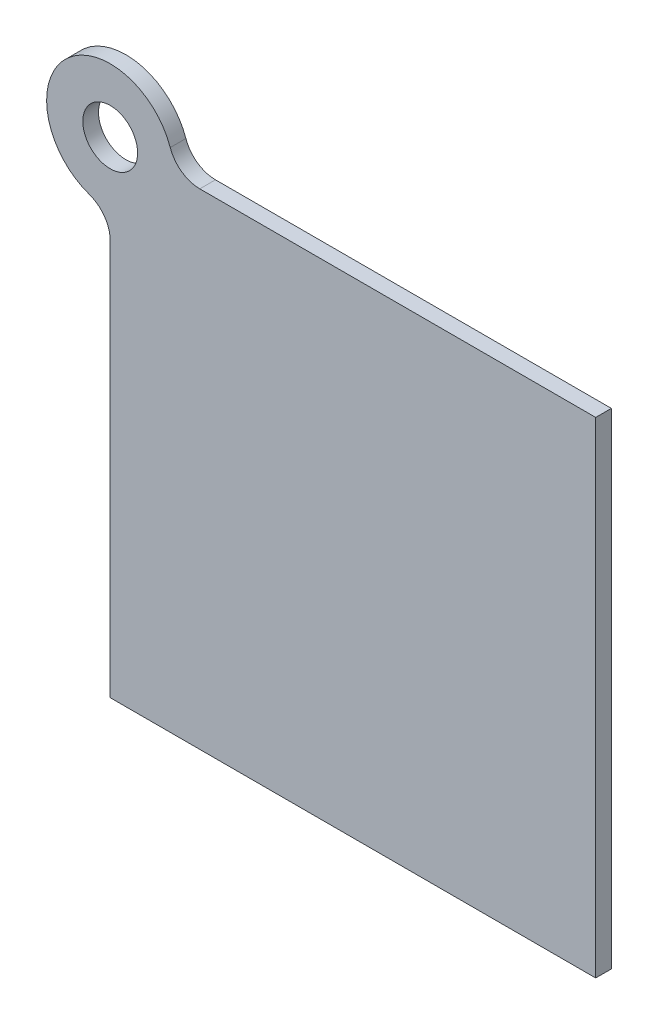
ISO-10303-21;
HEADER;
FILE_DESCRIPTION(('STEP AP214'),'2;1');
FILE_NAME('part.step','',(''),(''),'','','');
FILE_SCHEMA(('AUTOMOTIVE_DESIGN { 1 0 10303 214 1 1 1 1 }'));
ENDSEC;
DATA;
#1=APPLICATION_CONTEXT('core data for automotive mechanical design processes');
#2=APPLICATION_PROTOCOL_DEFINITION('international standard','automotive_design',2000,#1);
#3=PRODUCT_CONTEXT('',#1,'mechanical');
#4=PRODUCT('Part','Part','',(#3));
#5=PRODUCT_RELATED_PRODUCT_CATEGORY('part','',(#4));
#6=PRODUCT_DEFINITION_FORMATION('','',#4);
#7=PRODUCT_DEFINITION_CONTEXT('part definition',#1,'design');
#8=PRODUCT_DEFINITION('design','',#6,#7);
#9=PRODUCT_DEFINITION_SHAPE('','',#8);
#10=(LENGTH_UNIT() NAMED_UNIT(*) SI_UNIT(.MILLI.,.METRE.));
#11=(NAMED_UNIT(*) PLANE_ANGLE_UNIT() SI_UNIT($,.RADIAN.));
#12=(NAMED_UNIT(*) SI_UNIT($,.STERADIAN.) SOLID_ANGLE_UNIT());
#13=UNCERTAINTY_MEASURE_WITH_UNIT(LENGTH_MEASURE(1.E-05),#10,'distance_accuracy_value','');
#14=(GEOMETRIC_REPRESENTATION_CONTEXT(3) GLOBAL_UNCERTAINTY_ASSIGNED_CONTEXT((#13)) GLOBAL_UNIT_ASSIGNED_CONTEXT((#10,
#11,#12)) REPRESENTATION_CONTEXT('',''));
#15=CARTESIAN_POINT('',(0.,0.,0.));
#16=DIRECTION('',(0.,0.,1.));
#17=DIRECTION('',(1.,0.,0.));
#18=AXIS2_PLACEMENT_3D('',#15,#16,#17);
#19=CARTESIAN_POINT('',(0.,0.,2.54));
#20=DIRECTION('',(0.,0.,1.));
#21=DIRECTION('',(1.,0.,0.));
#22=AXIS2_PLACEMENT_3D('',#19,#20,#21);
#23=PLANE('',#22);
#24=DIRECTION('',(1.,0.,0.));
#25=VECTOR('',#24,1.);
#26=CARTESIAN_POINT('',(0.,-78.74,2.54));
#27=LINE('',#26,#25);
#28=CARTESIAN_POINT('',(0.,-78.74,2.54));
#29=VERTEX_POINT('',#28);
#30=CARTESIAN_POINT('',(78.74,-78.74,2.54));
#31=VERTEX_POINT('',#30);
#32=EDGE_CURVE('E102',#29,#31,#27,.T.);
#33=ORIENTED_EDGE('',*,*,#32,.T.);
#34=DIRECTION('',(0.,1.,0.));
#35=VECTOR('',#34,1.);
#36=CARTESIAN_POINT('',(78.74,-78.74,2.54));
#37=LINE('',#36,#35);
#38=CARTESIAN_POINT('',(78.74,0.,2.54));
#39=VERTEX_POINT('',#38);
#40=EDGE_CURVE('E92',#31,#39,#37,.T.);
#41=ORIENTED_EDGE('',*,*,#40,.T.);
#42=DIRECTION('',(-1.,0.,0.));
#43=VECTOR('',#42,1.);
#44=CARTESIAN_POINT('',(78.74,0.,2.54));
#45=LINE('',#44,#43);
#46=CARTESIAN_POINT('',(14.5299544995846,0.,2.54));
#47=VERTEX_POINT('',#46);
#48=EDGE_CURVE('E101',#39,#47,#45,.T.);
#49=ORIENTED_EDGE('',*,*,#48,.T.);
#50=CARTESIAN_POINT('',(14.5299544995846,5.07999999999999,2.54));
#51=DIRECTION('',(0.,0.,1.));
#52=DIRECTION('',(1.,0.,0.));
#53=AXIS2_PLACEMENT_3D('',#50,#51,#52);
#54=CIRCLE('',#53,5.08);
#55=CARTESIAN_POINT('',(9.73458997826958,3.40343234323432,2.54));
#56=VERTEX_POINT('',#55);
#57=EDGE_CURVE('E11',#47,#56,#54,.F.);
#58=ORIENTED_EDGE('',*,*,#57,.T.);
#59=CARTESIAN_POINT('',(0.,0.,2.54));
#60=DIRECTION('',(0.,0.,1.));
#61=DIRECTION('',(1.,0.,0.));
#62=AXIS2_PLACEMENT_3D('',#59,#60,#61);
#63=CIRCLE('',#62,10.3124);
#64=CARTESIAN_POINT('',(-3.40343234323432,-9.73458997826958,2.54));
#65=VERTEX_POINT('',#64);
#66=EDGE_CURVE('E136',#56,#65,#63,.T.);
#67=ORIENTED_EDGE('',*,*,#66,.T.);
#68=CARTESIAN_POINT('',(-5.08,-14.5299544995846,2.54));
#69=DIRECTION('',(0.,0.,1.));
#70=DIRECTION('',(1.,0.,0.));
#71=AXIS2_PLACEMENT_3D('',#68,#69,#70);
#72=CIRCLE('',#71,5.08);
#73=CARTESIAN_POINT('',(0.,-14.5299544995846,2.54));
#74=VERTEX_POINT('',#73);
#75=EDGE_CURVE('E132',#65,#74,#72,.F.);
#76=ORIENTED_EDGE('',*,*,#75,.T.);
#77=DIRECTION('',(0.,-1.,0.));
#78=VECTOR('',#77,1.);
#79=CARTESIAN_POINT('',(0.,-10.3124,2.54));
#80=LINE('',#79,#78);
#81=EDGE_CURVE('E107',#74,#29,#80,.T.);
#82=ORIENTED_EDGE('',*,*,#81,.T.);
#83=EDGE_LOOP('',(#33,#41,#49,#58,#67,#76,#82));
#84=FACE_BOUND('',#83,.T.);
#85=CARTESIAN_POINT('',(0.,0.,2.54));
#86=DIRECTION('',(0.,0.,1.));
#87=DIRECTION('',(1.,0.,0.));
#88=AXIS2_PLACEMENT_3D('',#85,#86,#87);
#89=CIRCLE('',#88,4.445);
#90=CARTESIAN_POINT('',(4.445,0.,2.54));
#91=VERTEX_POINT('',#90);
#92=EDGE_CURVE('E158',#91,#91,#89,.T.);
#93=ORIENTED_EDGE('',*,*,#92,.F.);
#94=EDGE_LOOP('',(#93));
#95=FACE_BOUND('',#94,.T.);
#96=ADVANCED_FACE('F33',(#84,#95),#23,.T.);
#97=CARTESIAN_POINT('',(0.,0.,0.));
#98=DIRECTION('',(0.,0.,1.));
#99=DIRECTION('',(1.,0.,0.));
#100=AXIS2_PLACEMENT_3D('',#97,#98,#99);
#101=PLANE('',#100);
#102=DIRECTION('',(1.,0.,0.));
#103=VECTOR('',#102,1.);
#104=CARTESIAN_POINT('',(0.,-78.74,0.));
#105=LINE('',#104,#103);
#106=CARTESIAN_POINT('',(0.,-78.74,0.));
#107=VERTEX_POINT('',#106);
#108=CARTESIAN_POINT('',(78.74,-78.74,0.));
#109=VERTEX_POINT('',#108);
#110=EDGE_CURVE('E115',#107,#109,#105,.T.);
#111=ORIENTED_EDGE('',*,*,#110,.F.);
#112=DIRECTION('',(0.,-1.,0.));
#113=VECTOR('',#112,1.);
#114=CARTESIAN_POINT('',(0.,-10.3124,0.));
#115=LINE('',#114,#113);
#116=CARTESIAN_POINT('',(0.,-14.5299544995846,0.));
#117=VERTEX_POINT('',#116);
#118=EDGE_CURVE('E111',#117,#107,#115,.T.);
#119=ORIENTED_EDGE('',*,*,#118,.F.);
#120=CARTESIAN_POINT('',(-5.08,-14.5299544995846,0.));
#121=DIRECTION('',(0.,0.,1.));
#122=DIRECTION('',(1.,0.,0.));
#123=AXIS2_PLACEMENT_3D('',#120,#121,#122);
#124=CIRCLE('',#123,5.08);
#125=CARTESIAN_POINT('',(-3.40343234323432,-9.73458997826958,0.));
#126=VERTEX_POINT('',#125);
#127=EDGE_CURVE('E130',#117,#126,#124,.T.);
#128=ORIENTED_EDGE('',*,*,#127,.T.);
#129=CARTESIAN_POINT('',(0.,0.,0.));
#130=DIRECTION('',(0.,0.,1.));
#131=DIRECTION('',(1.,0.,0.));
#132=AXIS2_PLACEMENT_3D('',#129,#130,#131);
#133=CIRCLE('',#132,10.3124);
#134=CARTESIAN_POINT('',(9.73458997826958,3.40343234323432,0.));
#135=VERTEX_POINT('',#134);
#136=EDGE_CURVE('E148',#135,#126,#133,.T.);
#137=ORIENTED_EDGE('',*,*,#136,.F.);
#138=CARTESIAN_POINT('',(14.5299544995846,5.07999999999999,0.));
#139=DIRECTION('',(0.,0.,1.));
#140=DIRECTION('',(1.,0.,0.));
#141=AXIS2_PLACEMENT_3D('',#138,#139,#140);
#142=CIRCLE('',#141,5.08);
#143=CARTESIAN_POINT('',(14.5299544995846,0.,0.));
#144=VERTEX_POINT('',#143);
#145=EDGE_CURVE('E41',#135,#144,#142,.T.);
#146=ORIENTED_EDGE('',*,*,#145,.T.);
#147=DIRECTION('',(-1.,0.,0.));
#148=VECTOR('',#147,1.);
#149=CARTESIAN_POINT('',(78.74,0.,0.));
#150=LINE('',#149,#148);
#151=CARTESIAN_POINT('',(78.74,0.,0.));
#152=VERTEX_POINT('',#151);
#153=EDGE_CURVE('E152',#152,#144,#150,.T.);
#154=ORIENTED_EDGE('',*,*,#153,.F.);
#155=DIRECTION('',(0.,1.,0.));
#156=VECTOR('',#155,1.);
#157=CARTESIAN_POINT('',(78.74,-78.74,0.));
#158=LINE('',#157,#156);
#159=EDGE_CURVE('E155',#109,#152,#158,.T.);
#160=ORIENTED_EDGE('',*,*,#159,.F.);
#161=EDGE_LOOP('',(#111,#119,#128,#137,#146,#154,#160));
#162=FACE_BOUND('',#161,.T.);
#163=CARTESIAN_POINT('',(0.,0.,0.));
#164=DIRECTION('',(0.,0.,1.));
#165=DIRECTION('',(1.,0.,0.));
#166=AXIS2_PLACEMENT_3D('',#163,#164,#165);
#167=CIRCLE('',#166,4.445);
#168=CARTESIAN_POINT('',(4.445,0.,0.));
#169=VERTEX_POINT('',#168);
#170=EDGE_CURVE('E161',#169,#169,#167,.T.);
#171=ORIENTED_EDGE('',*,*,#170,.T.);
#172=EDGE_LOOP('',(#171));
#173=FACE_BOUND('',#172,.T.);
#174=ADVANCED_FACE('F146',(#162,#173),#101,.F.);
#175=CARTESIAN_POINT('',(0.,-78.74,2.54));
#176=DIRECTION('',(0.,1.,0.));
#177=DIRECTION('',(0.,0.,1.));
#178=AXIS2_PLACEMENT_3D('',#175,#176,#177);
#179=PLANE('',#178);
#180=ORIENTED_EDGE('',*,*,#110,.T.);
#181=DIRECTION('',(0.,0.,-1.));
#182=VECTOR('',#181,1.);
#183=CARTESIAN_POINT('',(78.74,-78.74,2.54));
#184=LINE('',#183,#182);
#185=EDGE_CURVE('E96',#31,#109,#184,.T.);
#186=ORIENTED_EDGE('',*,*,#185,.F.);
#187=ORIENTED_EDGE('',*,*,#32,.F.);
#188=DIRECTION('',(0.,0.,-1.));
#189=VECTOR('',#188,1.);
#190=CARTESIAN_POINT('',(0.,-78.74,2.54));
#191=LINE('',#190,#189);
#192=EDGE_CURVE('E121',#29,#107,#191,.T.);
#193=ORIENTED_EDGE('',*,*,#192,.T.);
#194=EDGE_LOOP('',(#180,#186,#187,#193));
#195=FACE_BOUND('',#194,.T.);
#196=ADVANCED_FACE('F113',(#195),#179,.F.);
#197=CARTESIAN_POINT('',(78.74,-78.74,2.54));
#198=DIRECTION('',(-1.,0.,0.));
#199=DIRECTION('',(0.,0.,1.));
#200=AXIS2_PLACEMENT_3D('',#197,#198,#199);
#201=PLANE('',#200);
#202=ORIENTED_EDGE('',*,*,#159,.T.);
#203=DIRECTION('',(0.,0.,-1.));
#204=VECTOR('',#203,1.);
#205=CARTESIAN_POINT('',(78.74,0.,2.54));
#206=LINE('',#205,#204);
#207=EDGE_CURVE('E99',#39,#152,#206,.T.);
#208=ORIENTED_EDGE('',*,*,#207,.F.);
#209=ORIENTED_EDGE('',*,*,#40,.F.);
#210=ORIENTED_EDGE('',*,*,#185,.T.);
#211=EDGE_LOOP('',(#202,#208,#209,#210));
#212=FACE_BOUND('',#211,.T.);
#213=ADVANCED_FACE('F94',(#212),#201,.F.);
#214=CARTESIAN_POINT('',(78.74,0.,2.54));
#215=DIRECTION('',(0.,-1.,0.));
#216=DIRECTION('',(1.,0.,0.));
#217=AXIS2_PLACEMENT_3D('',#214,#215,#216);
#218=PLANE('',#217);
#219=ORIENTED_EDGE('',*,*,#153,.T.);
#220=DIRECTION('',(0.,0.,1.));
#221=VECTOR('',#220,1.);
#222=CARTESIAN_POINT('',(14.5299544995846,0.,2.54));
#223=LINE('',#222,#221);
#224=EDGE_CURVE('E48',#144,#47,#223,.T.);
#225=ORIENTED_EDGE('',*,*,#224,.T.);
#226=ORIENTED_EDGE('',*,*,#48,.F.);
#227=ORIENTED_EDGE('',*,*,#207,.T.);
#228=EDGE_LOOP('',(#219,#225,#226,#227));
#229=FACE_BOUND('',#228,.T.);
#230=ADVANCED_FACE('F187',(#229),#218,.F.);
#231=CARTESIAN_POINT('',(0.,0.,2.54));
#232=DIRECTION('',(0.,0.,-1.));
#233=DIRECTION('',(-1.,0.,0.));
#234=AXIS2_PLACEMENT_3D('',#231,#232,#233);
#235=CYLINDRICAL_SURFACE('',#234,10.3124);
#236=ORIENTED_EDGE('',*,*,#136,.T.);
#237=DIRECTION('',(0.,0.,-1.));
#238=VECTOR('',#237,1.);
#239=CARTESIAN_POINT('',(-3.40343234323432,-9.73458997826958,2.54));
#240=LINE('',#239,#238);
#241=EDGE_CURVE('E127',#126,#65,#240,.F.);
#242=ORIENTED_EDGE('',*,*,#241,.T.);
#243=ORIENTED_EDGE('',*,*,#66,.F.);
#244=DIRECTION('',(0.,0.,-1.));
#245=VECTOR('',#244,1.);
#246=CARTESIAN_POINT('',(9.73458997826958,3.40343234323432,2.54));
#247=LINE('',#246,#245);
#248=EDGE_CURVE('E119',#56,#135,#247,.T.);
#249=ORIENTED_EDGE('',*,*,#248,.T.);
#250=EDGE_LOOP('',(#236,#242,#243,#249));
#251=FACE_BOUND('',#250,.T.);
#252=ADVANCED_FACE('F150',(#251),#235,.T.);
#253=CARTESIAN_POINT('',(0.,-10.3124,2.54));
#254=DIRECTION('',(1.,0.,0.));
#255=DIRECTION('',(0.,1.,0.));
#256=AXIS2_PLACEMENT_3D('',#253,#254,#255);
#257=PLANE('',#256);
#258=ORIENTED_EDGE('',*,*,#81,.F.);
#259=DIRECTION('',(0.,0.,1.));
#260=VECTOR('',#259,1.);
#261=CARTESIAN_POINT('',(0.,-14.5299544995846,0.));
#262=LINE('',#261,#260);
#263=EDGE_CURVE('E116',#74,#117,#262,.F.);
#264=ORIENTED_EDGE('',*,*,#263,.T.);
#265=ORIENTED_EDGE('',*,*,#118,.T.);
#266=ORIENTED_EDGE('',*,*,#192,.F.);
#267=EDGE_LOOP('',(#258,#264,#265,#266));
#268=FACE_BOUND('',#267,.T.);
#269=ADVANCED_FACE('F141',(#268),#257,.F.);
#270=CARTESIAN_POINT('',(0.,0.,2.54));
#271=DIRECTION('',(0.,0.,-1.));
#272=DIRECTION('',(-1.,0.,0.));
#273=AXIS2_PLACEMENT_3D('',#270,#271,#272);
#274=CYLINDRICAL_SURFACE('',#273,4.445);
#275=ORIENTED_EDGE('',*,*,#92,.T.);
#276=EDGE_LOOP('',(#275));
#277=FACE_BOUND('',#276,.T.);
#278=ORIENTED_EDGE('',*,*,#170,.F.);
#279=EDGE_LOOP('',(#278));
#280=FACE_BOUND('',#279,.T.);
#281=ADVANCED_FACE('F169',(#277,#280),#274,.F.);
#282=CARTESIAN_POINT('',(-5.08,-14.5299544995846,2.54));
#283=DIRECTION('',(0.,0.,-1.));
#284=DIRECTION('',(-1.,0.,0.));
#285=AXIS2_PLACEMENT_3D('',#282,#283,#284);
#286=CYLINDRICAL_SURFACE('',#285,5.08);
#287=ORIENTED_EDGE('',*,*,#75,.F.);
#288=ORIENTED_EDGE('',*,*,#241,.F.);
#289=ORIENTED_EDGE('',*,*,#127,.F.);
#290=ORIENTED_EDGE('',*,*,#263,.F.);
#291=EDGE_LOOP('',(#287,#288,#289,#290));
#292=FACE_BOUND('',#291,.T.);
#293=ADVANCED_FACE('F144',(#292),#286,.F.);
#294=CARTESIAN_POINT('',(14.5299544995846,5.07999999999999,2.54));
#295=DIRECTION('',(0.,0.,-1.));
#296=DIRECTION('',(-1.,0.,0.));
#297=AXIS2_PLACEMENT_3D('',#294,#295,#296);
#298=CYLINDRICAL_SURFACE('',#297,5.08);
#299=ORIENTED_EDGE('',*,*,#57,.F.);
#300=ORIENTED_EDGE('',*,*,#224,.F.);
#301=ORIENTED_EDGE('',*,*,#145,.F.);
#302=ORIENTED_EDGE('',*,*,#248,.F.);
#303=EDGE_LOOP('',(#299,#300,#301,#302));
#304=FACE_BOUND('',#303,.T.);
#305=ADVANCED_FACE('F35',(#304),#298,.F.);
#306=CLOSED_SHELL('',(#96,#174,#196,#213,#230,#252,#269,#281,#293,#305));
#307=MANIFOLD_SOLID_BREP('B2',#306);
#308=ADVANCED_BREP_SHAPE_REPRESENTATION('',(#18,#307),#14);
#309=SHAPE_DEFINITION_REPRESENTATION(#9,#308);
ENDSEC;
END-ISO-10303-21;
